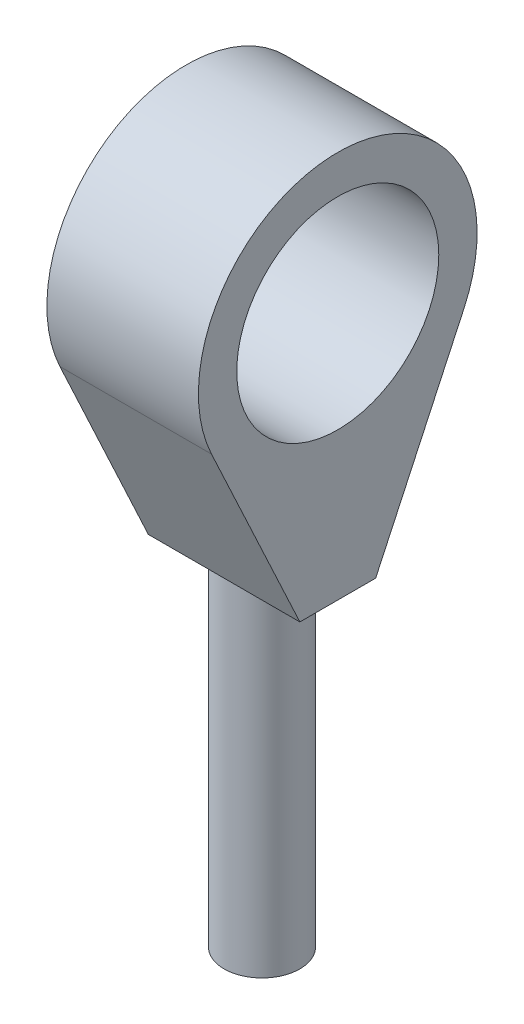
ISO-10303-21;
HEADER;
FILE_DESCRIPTION(('STEP AP214'),'2;1');
FILE_NAME('part.step','',(''),(''),'','','');
FILE_SCHEMA(('AUTOMOTIVE_DESIGN { 1 0 10303 214 1 1 1 1 }'));
ENDSEC;
DATA;
#1=APPLICATION_CONTEXT('core data for automotive mechanical design processes');
#2=APPLICATION_PROTOCOL_DEFINITION('international standard','automotive_design',2000,#1);
#3=PRODUCT_CONTEXT('',#1,'mechanical');
#4=PRODUCT('Part','Part','',(#3));
#5=PRODUCT_RELATED_PRODUCT_CATEGORY('part','',(#4));
#6=PRODUCT_DEFINITION_FORMATION('','',#4);
#7=PRODUCT_DEFINITION_CONTEXT('part definition',#1,'design');
#8=PRODUCT_DEFINITION('design','',#6,#7);
#9=PRODUCT_DEFINITION_SHAPE('','',#8);
#10=(LENGTH_UNIT() NAMED_UNIT(*) SI_UNIT(.MILLI.,.METRE.));
#11=(NAMED_UNIT(*) PLANE_ANGLE_UNIT() SI_UNIT($,.RADIAN.));
#12=(NAMED_UNIT(*) SI_UNIT($,.STERADIAN.) SOLID_ANGLE_UNIT());
#13=UNCERTAINTY_MEASURE_WITH_UNIT(LENGTH_MEASURE(1.E-05),#10,'distance_accuracy_value','');
#14=(GEOMETRIC_REPRESENTATION_CONTEXT(3) GLOBAL_UNCERTAINTY_ASSIGNED_CONTEXT((#13)) GLOBAL_UNIT_ASSIGNED_CONTEXT((#10,
#11,#12)) REPRESENTATION_CONTEXT('',''));
#15=CARTESIAN_POINT('',(0.,0.,0.));
#16=DIRECTION('',(0.,0.,1.));
#17=DIRECTION('',(1.,0.,0.));
#18=AXIS2_PLACEMENT_3D('',#15,#16,#17);
#19=CARTESIAN_POINT('',(0.,42.545,0.));
#20=DIRECTION('',(0.,-1.,0.));
#21=DIRECTION('',(0.,0.,-1.));
#22=AXIS2_PLACEMENT_3D('',#19,#20,#21);
#23=CYLINDRICAL_SURFACE('',#22,4.7625);
#24=CARTESIAN_POINT('',(0.,42.545,0.));
#25=DIRECTION('',(0.,1.,0.));
#26=DIRECTION('',(0.,0.,1.));
#27=AXIS2_PLACEMENT_3D('',#24,#25,#26);
#28=CIRCLE('',#27,4.7625);
#29=CARTESIAN_POINT('',(0.,42.545,4.7625));
#30=VERTEX_POINT('',#29);
#31=CARTESIAN_POINT('',(0.,42.545,-4.7625));
#32=VERTEX_POINT('',#31);
#33=EDGE_CURVE('E11',#30,#32,#28,.T.);
#34=ORIENTED_EDGE('',*,*,#33,.F.);
#35=EDGE_CURVE('E41',#32,#30,#28,.T.);
#36=ORIENTED_EDGE('',*,*,#35,.F.);
#37=EDGE_LOOP('',(#34,#36));
#38=FACE_BOUND('',#37,.T.);
#39=CARTESIAN_POINT('',(0.,0.,0.));
#40=DIRECTION('',(0.,1.,0.));
#41=DIRECTION('',(0.,0.,1.));
#42=AXIS2_PLACEMENT_3D('',#39,#40,#41);
#43=CIRCLE('',#42,4.7625);
#44=CARTESIAN_POINT('',(0.,0.,4.7625));
#45=VERTEX_POINT('',#44);
#46=EDGE_CURVE('E36',#45,#45,#43,.T.);
#47=ORIENTED_EDGE('',*,*,#46,.T.);
#48=EDGE_LOOP('',(#47));
#49=FACE_BOUND('',#48,.T.);
#50=ADVANCED_FACE('F33',(#38,#49),#23,.T.);
#51=CARTESIAN_POINT('',(0.,0.,0.));
#52=DIRECTION('',(0.,1.,0.));
#53=DIRECTION('',(0.,0.,1.));
#54=AXIS2_PLACEMENT_3D('',#51,#52,#53);
#55=PLANE('',#54);
#56=ORIENTED_EDGE('',*,*,#46,.F.);
#57=EDGE_LOOP('',(#56));
#58=FACE_BOUND('',#57,.T.);
#59=ADVANCED_FACE('F148',(#58),#55,.F.);
#60=CARTESIAN_POINT('',(-9.525,42.545,4.7625));
#61=DIRECTION('',(0.,-1.,0.));
#62=DIRECTION('',(0.,0.,-1.));
#63=AXIS2_PLACEMENT_3D('',#60,#61,#62);
#64=PLANE('',#63);
#65=DIRECTION('',(1.,0.,0.));
#66=VECTOR('',#65,1.);
#67=CARTESIAN_POINT('',(-9.525,42.545,4.7625));
#68=LINE('',#67,#66);
#69=CARTESIAN_POINT('',(9.525,42.545,4.7625));
#70=VERTEX_POINT('',#69);
#71=EDGE_CURVE('E123',#30,#70,#68,.T.);
#72=ORIENTED_EDGE('',*,*,#71,.F.);
#73=ORIENTED_EDGE('',*,*,#33,.T.);
#74=DIRECTION('',(1.,0.,0.));
#75=VECTOR('',#74,1.);
#76=CARTESIAN_POINT('',(-9.525,42.545,-4.7625));
#77=LINE('',#76,#75);
#78=CARTESIAN_POINT('',(9.525,42.545,-4.7625));
#79=VERTEX_POINT('',#78);
#80=EDGE_CURVE('E74',#32,#79,#77,.T.);
#81=ORIENTED_EDGE('',*,*,#80,.T.);
#82=DIRECTION('',(0.,0.,-1.));
#83=VECTOR('',#82,1.);
#84=CARTESIAN_POINT('',(9.525,42.545,4.7625));
#85=LINE('',#84,#83);
#86=EDGE_CURVE('E79',#70,#79,#85,.T.);
#87=ORIENTED_EDGE('',*,*,#86,.F.);
#88=EDGE_LOOP('',(#72,#73,#81,#87));
#89=FACE_BOUND('',#88,.T.);
#90=ADVANCED_FACE('F77',(#89),#64,.T.);
#91=CARTESIAN_POINT('',(-9.525,42.545,-4.7625));
#92=VERTEX_POINT('',#91);
#93=EDGE_CURVE('E82',#92,#32,#77,.T.);
#94=ORIENTED_EDGE('',*,*,#93,.T.);
#95=ORIENTED_EDGE('',*,*,#35,.T.);
#96=CARTESIAN_POINT('',(-9.525,42.545,4.7625));
#97=VERTEX_POINT('',#96);
#98=EDGE_CURVE('E120',#97,#30,#68,.T.);
#99=ORIENTED_EDGE('',*,*,#98,.F.);
#100=DIRECTION('',(0.,0.,-1.));
#101=VECTOR('',#100,1.);
#102=CARTESIAN_POINT('',(-9.525,42.545,4.7625));
#103=LINE('',#102,#101);
#104=EDGE_CURVE('E110',#97,#92,#103,.T.);
#105=ORIENTED_EDGE('',*,*,#104,.T.);
#106=EDGE_LOOP('',(#94,#95,#99,#105));
#107=FACE_BOUND('',#106,.T.);
#108=ADVANCED_FACE('F127',(#107),#64,.T.);
#109=CARTESIAN_POINT('',(-9.525,42.545,4.7625));
#110=DIRECTION('',(0.,-0.422618261740694,0.906307787036652));
#111=DIRECTION('',(0.,-0.906307787036653,-0.422618261740694));
#112=AXIS2_PLACEMENT_3D('',#109,#110,#111);
#113=PLANE('',#112);
#114=ORIENTED_EDGE('',*,*,#98,.T.);
#115=ORIENTED_EDGE('',*,*,#71,.T.);
#116=DIRECTION('',(0.,-0.906307787036652,-0.422618261740694));
#117=VECTOR('',#116,1.);
#118=CARTESIAN_POINT('',(9.525,42.545,4.7625));
#119=LINE('',#118,#117);
#120=CARTESIAN_POINT('',(9.525,66.3758331541629,15.875));
#121=VERTEX_POINT('',#120);
#122=EDGE_CURVE('E99',#121,#70,#119,.T.);
#123=ORIENTED_EDGE('',*,*,#122,.F.);
#124=DIRECTION('',(1.,0.,0.));
#125=VECTOR('',#124,1.);
#126=CARTESIAN_POINT('',(-9.525,66.3758331541629,15.875));
#127=LINE('',#126,#125);
#128=CARTESIAN_POINT('',(-9.525,66.3758331541629,15.875));
#129=VERTEX_POINT('',#128);
#130=EDGE_CURVE('E124',#129,#121,#127,.T.);
#131=ORIENTED_EDGE('',*,*,#130,.F.);
#132=DIRECTION('',(0.,-0.906307787036652,-0.422618261740694));
#133=VECTOR('',#132,1.);
#134=CARTESIAN_POINT('',(-9.525,42.545,4.7625));
#135=LINE('',#134,#133);
#136=EDGE_CURVE('E83',#129,#97,#135,.T.);
#137=ORIENTED_EDGE('',*,*,#136,.T.);
#138=EDGE_LOOP('',(#114,#115,#123,#131,#137));
#139=FACE_BOUND('',#138,.T.);
#140=ADVANCED_FACE('F137',(#139),#113,.T.);
#141=CARTESIAN_POINT('',(-9.525,73.7784672273734,0.));
#142=DIRECTION('',(1.,0.,0.));
#143=DIRECTION('',(0.,0.,-1.));
#144=AXIS2_PLACEMENT_3D('',#141,#142,#143);
#145=CYLINDRICAL_SURFACE('',#144,17.5161244635295);
#146=ORIENTED_EDGE('',*,*,#130,.T.);
#147=CARTESIAN_POINT('',(9.525,73.7784672273734,0.));
#148=DIRECTION('',(1.,0.,0.));
#149=DIRECTION('',(0.,0.,1.));
#150=AXIS2_PLACEMENT_3D('',#147,#148,#149);
#151=CIRCLE('',#150,17.5161244635295);
#152=CARTESIAN_POINT('',(9.525,66.3758331541629,-15.875));
#153=VERTEX_POINT('',#152);
#154=EDGE_CURVE('E93',#153,#121,#151,.T.);
#155=ORIENTED_EDGE('',*,*,#154,.F.);
#156=DIRECTION('',(1.,0.,0.));
#157=VECTOR('',#156,1.);
#158=CARTESIAN_POINT('',(-9.525,66.3758331541629,-15.875));
#159=LINE('',#158,#157);
#160=CARTESIAN_POINT('',(-9.525,66.3758331541629,-15.875));
#161=VERTEX_POINT('',#160);
#162=EDGE_CURVE('E89',#161,#153,#159,.T.);
#163=ORIENTED_EDGE('',*,*,#162,.F.);
#164=CARTESIAN_POINT('',(-9.525,73.7784672273734,0.));
#165=DIRECTION('',(1.,0.,0.));
#166=DIRECTION('',(0.,0.,1.));
#167=AXIS2_PLACEMENT_3D('',#164,#165,#166);
#168=CIRCLE('',#167,17.5161244635295);
#169=EDGE_CURVE('E115',#161,#129,#168,.T.);
#170=ORIENTED_EDGE('',*,*,#169,.T.);
#171=EDGE_LOOP('',(#146,#155,#163,#170));
#172=FACE_BOUND('',#171,.T.);
#173=ADVANCED_FACE('F135',(#172),#145,.T.);
#174=CARTESIAN_POINT('',(-9.525,42.545,-4.7625));
#175=DIRECTION('',(0.,-0.422618261740693,-0.906307787036653));
#176=DIRECTION('',(0.,0.906307787036653,-0.422618261740693));
#177=AXIS2_PLACEMENT_3D('',#174,#175,#176);
#178=PLANE('',#177);
#179=ORIENTED_EDGE('',*,*,#162,.T.);
#180=DIRECTION('',(0.,0.906307787036653,-0.422618261740693));
#181=VECTOR('',#180,1.);
#182=CARTESIAN_POINT('',(9.525,42.545,-4.7625));
#183=LINE('',#182,#181);
#184=EDGE_CURVE('E86',#79,#153,#183,.T.);
#185=ORIENTED_EDGE('',*,*,#184,.F.);
#186=ORIENTED_EDGE('',*,*,#80,.F.);
#187=ORIENTED_EDGE('',*,*,#93,.F.);
#188=DIRECTION('',(0.,0.906307787036653,-0.422618261740693));
#189=VECTOR('',#188,1.);
#190=CARTESIAN_POINT('',(-9.525,42.545,-4.7625));
#191=LINE('',#190,#189);
#192=EDGE_CURVE('E113',#92,#161,#191,.T.);
#193=ORIENTED_EDGE('',*,*,#192,.T.);
#194=EDGE_LOOP('',(#179,#185,#186,#187,#193));
#195=FACE_BOUND('',#194,.T.);
#196=ADVANCED_FACE('F87',(#195),#178,.T.);
#197=CARTESIAN_POINT('',(-9.525,73.7784672273734,0.));
#198=DIRECTION('',(-1.,0.,0.));
#199=DIRECTION('',(0.,0.,1.));
#200=AXIS2_PLACEMENT_3D('',#197,#198,#199);
#201=PLANE('',#200);
#202=CARTESIAN_POINT('',(-9.525,73.7784672273734,0.));
#203=DIRECTION('',(1.,0.,0.));
#204=DIRECTION('',(0.,0.,-1.));
#205=AXIS2_PLACEMENT_3D('',#202,#203,#204);
#206=CIRCLE('',#205,12.7);
#207=CARTESIAN_POINT('',(-9.525,73.7784672273734,-12.7));
#208=VERTEX_POINT('',#207);
#209=EDGE_CURVE('E107',#208,#208,#206,.T.);
#210=ORIENTED_EDGE('',*,*,#209,.T.);
#211=EDGE_LOOP('',(#210));
#212=FACE_BOUND('',#211,.T.);
#213=ORIENTED_EDGE('',*,*,#104,.F.);
#214=ORIENTED_EDGE('',*,*,#136,.F.);
#215=ORIENTED_EDGE('',*,*,#169,.F.);
#216=ORIENTED_EDGE('',*,*,#192,.F.);
#217=EDGE_LOOP('',(#213,#214,#215,#216));
#218=FACE_BOUND('',#217,.T.);
#219=ADVANCED_FACE('F132',(#212,#218),#201,.T.);
#220=CARTESIAN_POINT('',(-9.525,73.7784672273734,0.));
#221=DIRECTION('',(1.,0.,0.));
#222=DIRECTION('',(0.,0.,-1.));
#223=AXIS2_PLACEMENT_3D('',#220,#221,#222);
#224=CYLINDRICAL_SURFACE('',#223,12.7);
#225=ORIENTED_EDGE('',*,*,#209,.F.);
#226=EDGE_LOOP('',(#225));
#227=FACE_BOUND('',#226,.T.);
#228=CARTESIAN_POINT('',(9.525,73.7784672273734,0.));
#229=DIRECTION('',(1.,0.,0.));
#230=DIRECTION('',(0.,0.,-1.));
#231=AXIS2_PLACEMENT_3D('',#228,#229,#230);
#232=CIRCLE('',#231,12.7);
#233=CARTESIAN_POINT('',(9.525,73.7784672273734,-12.7));
#234=VERTEX_POINT('',#233);
#235=EDGE_CURVE('E100',#234,#234,#232,.T.);
#236=ORIENTED_EDGE('',*,*,#235,.T.);
#237=EDGE_LOOP('',(#236));
#238=FACE_BOUND('',#237,.T.);
#239=ADVANCED_FACE('F164',(#227,#238),#224,.F.);
#240=CARTESIAN_POINT('',(9.525,73.7784672273734,0.));
#241=DIRECTION('',(-1.,0.,0.));
#242=DIRECTION('',(0.,0.,1.));
#243=AXIS2_PLACEMENT_3D('',#240,#241,#242);
#244=PLANE('',#243);
#245=ORIENTED_EDGE('',*,*,#86,.T.);
#246=ORIENTED_EDGE('',*,*,#184,.T.);
#247=ORIENTED_EDGE('',*,*,#154,.T.);
#248=ORIENTED_EDGE('',*,*,#122,.T.);
#249=EDGE_LOOP('',(#245,#246,#247,#248));
#250=FACE_BOUND('',#249,.T.);
#251=ORIENTED_EDGE('',*,*,#235,.F.);
#252=EDGE_LOOP('',(#251));
#253=FACE_BOUND('',#252,.T.);
#254=ADVANCED_FACE('F96',(#250,#253),#244,.F.);
#255=CLOSED_SHELL('',(#50,#59,#90,#108,#140,#173,#196,#219,#239,#254));
#256=MANIFOLD_SOLID_BREP('B2',#255);
#257=ADVANCED_BREP_SHAPE_REPRESENTATION('',(#18,#256),#14);
#258=SHAPE_DEFINITION_REPRESENTATION(#9,#257);
ENDSEC;
END-ISO-10303-21;
